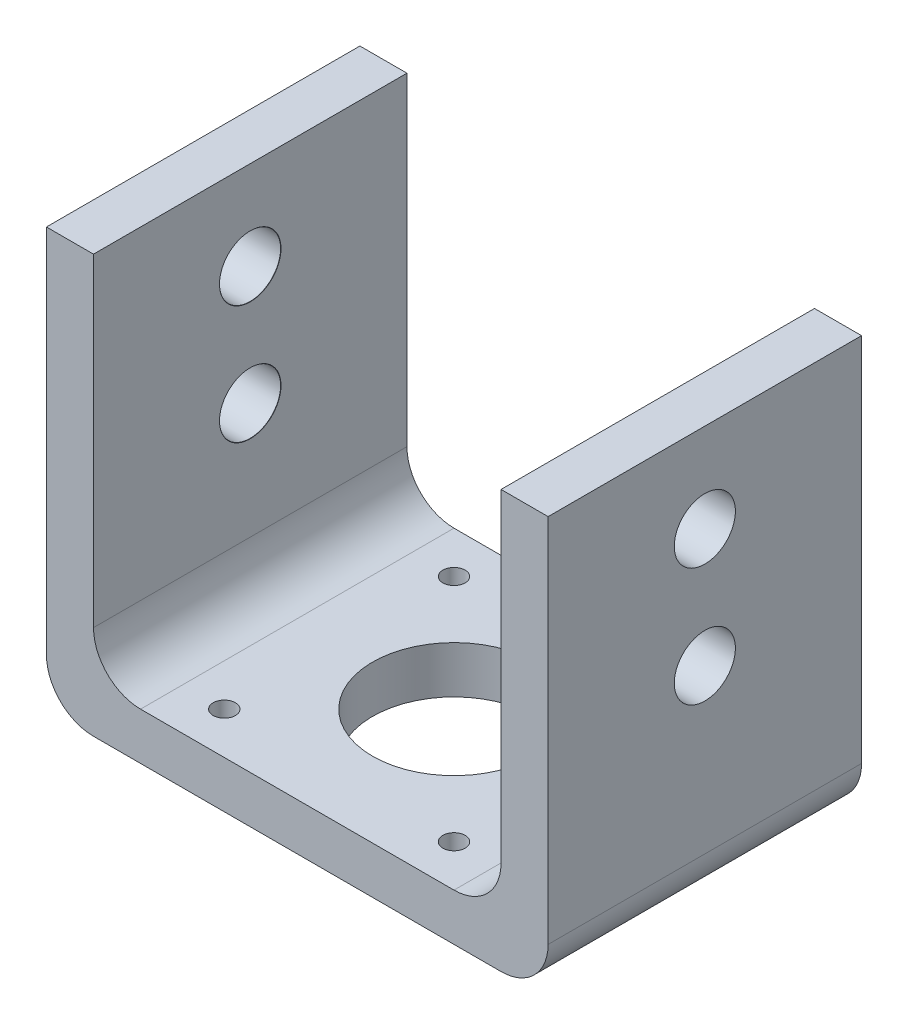
ISO-10303-21;
HEADER;
FILE_DESCRIPTION(('STEP AP214'),'2;1');
FILE_NAME('part.step','',(''),(''),'','','');
FILE_SCHEMA(('AUTOMOTIVE_DESIGN { 1 0 10303 214 1 1 1 1 }'));
ENDSEC;
DATA;
#1=APPLICATION_CONTEXT('core data for automotive mechanical design processes');
#2=APPLICATION_PROTOCOL_DEFINITION('international standard','automotive_design',2000,#1);
#3=PRODUCT_CONTEXT('',#1,'mechanical');
#4=PRODUCT('Part','Part','',(#3));
#5=PRODUCT_RELATED_PRODUCT_CATEGORY('part','',(#4));
#6=PRODUCT_DEFINITION_FORMATION('','',#4);
#7=PRODUCT_DEFINITION_CONTEXT('part definition',#1,'design');
#8=PRODUCT_DEFINITION('design','',#6,#7);
#9=PRODUCT_DEFINITION_SHAPE('','',#8);
#10=(LENGTH_UNIT() NAMED_UNIT(*) SI_UNIT(.MILLI.,.METRE.));
#11=(NAMED_UNIT(*) PLANE_ANGLE_UNIT() SI_UNIT($,.RADIAN.));
#12=(NAMED_UNIT(*) SI_UNIT($,.STERADIAN.) SOLID_ANGLE_UNIT());
#13=UNCERTAINTY_MEASURE_WITH_UNIT(LENGTH_MEASURE(1.E-05),#10,'distance_accuracy_value','');
#14=(GEOMETRIC_REPRESENTATION_CONTEXT(3) GLOBAL_UNCERTAINTY_ASSIGNED_CONTEXT((#13)) GLOBAL_UNIT_ASSIGNED_CONTEXT((#10,
#11,#12)) REPRESENTATION_CONTEXT('',''));
#15=CARTESIAN_POINT('',(0.,0.,0.));
#16=DIRECTION('',(0.,0.,1.));
#17=DIRECTION('',(1.,0.,0.));
#18=AXIS2_PLACEMENT_3D('',#15,#16,#17);
#19=CARTESIAN_POINT('',(0.,6.35,42.3));
#20=DIRECTION('',(0.,0.,-1.));
#21=DIRECTION('',(-1.,0.,0.));
#22=AXIS2_PLACEMENT_3D('',#19,#20,#21);
#23=PLANE('',#22);
#24=DIRECTION('',(0.,-1.,0.));
#25=VECTOR('',#24,1.);
#26=CARTESIAN_POINT('',(-12.7,6.35,42.3));
#27=LINE('',#26,#25);
#28=CARTESIAN_POINT('',(-12.7,56.35,42.3));
#29=VERTEX_POINT('',#28);
#30=CARTESIAN_POINT('',(-12.7,6.35,42.3));
#31=VERTEX_POINT('',#30);
#32=EDGE_CURVE('E142',#29,#31,#27,.T.);
#33=ORIENTED_EDGE('',*,*,#32,.T.);
#34=CARTESIAN_POINT('',(-6.35000000000001,6.35,42.3));
#35=DIRECTION('',(0.,0.,-1.));
#36=DIRECTION('',(-1.,0.,0.));
#37=AXIS2_PLACEMENT_3D('',#34,#35,#36);
#38=CIRCLE('',#37,6.35);
#39=CARTESIAN_POINT('',(-6.35000000000001,0.,42.3));
#40=VERTEX_POINT('',#39);
#41=EDGE_CURVE('E11',#31,#40,#38,.F.);
#42=ORIENTED_EDGE('',*,*,#41,.T.);
#43=DIRECTION('',(1.,0.,0.));
#44=VECTOR('',#43,1.);
#45=CARTESIAN_POINT('',(0.,0.,42.3));
#46=LINE('',#45,#44);
#47=CARTESIAN_POINT('',(48.65,0.,42.3));
#48=VERTEX_POINT('',#47);
#49=EDGE_CURVE('E264',#40,#48,#46,.T.);
#50=ORIENTED_EDGE('',*,*,#49,.T.);
#51=CARTESIAN_POINT('',(48.65,6.35,42.3));
#52=DIRECTION('',(0.,0.,-1.));
#53=DIRECTION('',(-1.,0.,0.));
#54=AXIS2_PLACEMENT_3D('',#51,#52,#53);
#55=CIRCLE('',#54,6.35);
#56=CARTESIAN_POINT('',(55.,6.35,42.3));
#57=VERTEX_POINT('',#56);
#58=EDGE_CURVE('E305',#48,#57,#55,.F.);
#59=ORIENTED_EDGE('',*,*,#58,.T.);
#60=DIRECTION('',(0.,-1.,0.));
#61=VECTOR('',#60,1.);
#62=CARTESIAN_POINT('',(55.,6.35,42.3));
#63=LINE('',#62,#61);
#64=CARTESIAN_POINT('',(55.,56.35,42.3));
#65=VERTEX_POINT('',#64);
#66=EDGE_CURVE('E220',#65,#57,#63,.T.);
#67=ORIENTED_EDGE('',*,*,#66,.F.);
#68=DIRECTION('',(1.,0.,0.));
#69=VECTOR('',#68,1.);
#70=CARTESIAN_POINT('',(48.65,56.35,42.3));
#71=LINE('',#70,#69);
#72=CARTESIAN_POINT('',(48.65,56.35,42.3));
#73=VERTEX_POINT('',#72);
#74=EDGE_CURVE('E201',#73,#65,#71,.T.);
#75=ORIENTED_EDGE('',*,*,#74,.F.);
#76=DIRECTION('',(0.,-1.,0.));
#77=VECTOR('',#76,1.);
#78=CARTESIAN_POINT('',(48.65,56.35,42.3));
#79=LINE('',#78,#77);
#80=CARTESIAN_POINT('',(48.65,12.7,42.3));
#81=VERTEX_POINT('',#80);
#82=EDGE_CURVE('E216',#73,#81,#79,.T.);
#83=ORIENTED_EDGE('',*,*,#82,.T.);
#84=CARTESIAN_POINT('',(42.3,12.7,42.3));
#85=DIRECTION('',(0.,0.,-1.));
#86=DIRECTION('',(-1.,0.,0.));
#87=AXIS2_PLACEMENT_3D('',#84,#85,#86);
#88=CIRCLE('',#87,6.35);
#89=CARTESIAN_POINT('',(42.3,6.35,42.3));
#90=VERTEX_POINT('',#89);
#91=EDGE_CURVE('E287',#81,#90,#88,.T.);
#92=ORIENTED_EDGE('',*,*,#91,.T.);
#93=DIRECTION('',(1.,0.,0.));
#94=VECTOR('',#93,1.);
#95=CARTESIAN_POINT('',(0.,6.35,42.3));
#96=LINE('',#95,#94);
#97=CARTESIAN_POINT('',(0.,6.35,42.3));
#98=VERTEX_POINT('',#97);
#99=EDGE_CURVE('E268',#98,#90,#96,.T.);
#100=ORIENTED_EDGE('',*,*,#99,.F.);
#101=CARTESIAN_POINT('',(0.,12.7,42.3));
#102=DIRECTION('',(0.,0.,-1.));
#103=DIRECTION('',(-1.,0.,0.));
#104=AXIS2_PLACEMENT_3D('',#101,#102,#103);
#105=CIRCLE('',#104,6.35);
#106=CARTESIAN_POINT('',(-6.35,12.7,42.3));
#107=VERTEX_POINT('',#106);
#108=EDGE_CURVE('E314',#98,#107,#105,.T.);
#109=ORIENTED_EDGE('',*,*,#108,.T.);
#110=DIRECTION('',(0.,-1.,0.));
#111=VECTOR('',#110,1.);
#112=CARTESIAN_POINT('',(-6.35,56.35,42.3));
#113=LINE('',#112,#111);
#114=CARTESIAN_POINT('',(-6.35,56.35,42.3));
#115=VERTEX_POINT('',#114);
#116=EDGE_CURVE('E143',#115,#107,#113,.T.);
#117=ORIENTED_EDGE('',*,*,#116,.F.);
#118=DIRECTION('',(-1.,0.,0.));
#119=VECTOR('',#118,1.);
#120=CARTESIAN_POINT('',(-6.35,56.35,42.3));
#121=LINE('',#120,#119);
#122=EDGE_CURVE('E152',#115,#29,#121,.T.);
#123=ORIENTED_EDGE('',*,*,#122,.T.);
#124=EDGE_LOOP('',(#33,#42,#50,#59,#67,#75,#83,#92,#100,#109,#117,#123));
#125=FACE_BOUND('',#124,.T.);
#126=ADVANCED_FACE('F43',(#125),#23,.F.);
#127=CARTESIAN_POINT('',(0.,6.35,0.));
#128=DIRECTION('',(0.,0.,1.));
#129=DIRECTION('',(1.,0.,0.));
#130=AXIS2_PLACEMENT_3D('',#127,#128,#129);
#131=PLANE('',#130);
#132=DIRECTION('',(-1.,0.,0.));
#133=VECTOR('',#132,1.);
#134=CARTESIAN_POINT('',(0.,0.,0.));
#135=LINE('',#134,#133);
#136=CARTESIAN_POINT('',(48.65,0.,0.));
#137=VERTEX_POINT('',#136);
#138=CARTESIAN_POINT('',(-6.35000000000001,0.,0.));
#139=VERTEX_POINT('',#138);
#140=EDGE_CURVE('E272',#137,#139,#135,.T.);
#141=ORIENTED_EDGE('',*,*,#140,.T.);
#142=CARTESIAN_POINT('',(-6.35000000000001,6.35,0.));
#143=DIRECTION('',(0.,0.,1.));
#144=DIRECTION('',(1.,0.,0.));
#145=AXIS2_PLACEMENT_3D('',#142,#143,#144);
#146=CIRCLE('',#145,6.35);
#147=CARTESIAN_POINT('',(-12.7,6.35,0.));
#148=VERTEX_POINT('',#147);
#149=EDGE_CURVE('E66',#139,#148,#146,.F.);
#150=ORIENTED_EDGE('',*,*,#149,.T.);
#151=DIRECTION('',(0.,1.,0.));
#152=VECTOR('',#151,1.);
#153=CARTESIAN_POINT('',(-12.7,6.35,0.));
#154=LINE('',#153,#152);
#155=CARTESIAN_POINT('',(-12.7,56.35,0.));
#156=VERTEX_POINT('',#155);
#157=EDGE_CURVE('E157',#148,#156,#154,.T.);
#158=ORIENTED_EDGE('',*,*,#157,.T.);
#159=DIRECTION('',(1.,0.,0.));
#160=VECTOR('',#159,1.);
#161=CARTESIAN_POINT('',(-6.35000000000001,56.35,0.));
#162=LINE('',#161,#160);
#163=CARTESIAN_POINT('',(-6.35000000000001,56.35,0.));
#164=VERTEX_POINT('',#163);
#165=EDGE_CURVE('E149',#156,#164,#162,.T.);
#166=ORIENTED_EDGE('',*,*,#165,.T.);
#167=DIRECTION('',(0.,-1.,0.));
#168=VECTOR('',#167,1.);
#169=CARTESIAN_POINT('',(-6.35000000000001,56.35,0.));
#170=LINE('',#169,#168);
#171=CARTESIAN_POINT('',(-6.35000000000001,12.7,0.));
#172=VERTEX_POINT('',#171);
#173=EDGE_CURVE('E131',#164,#172,#170,.T.);
#174=ORIENTED_EDGE('',*,*,#173,.T.);
#175=CARTESIAN_POINT('',(0.,12.7,0.));
#176=DIRECTION('',(0.,0.,1.));
#177=DIRECTION('',(1.,0.,0.));
#178=AXIS2_PLACEMENT_3D('',#175,#176,#177);
#179=CIRCLE('',#178,6.35);
#180=CARTESIAN_POINT('',(0.,6.35,0.));
#181=VERTEX_POINT('',#180);
#182=EDGE_CURVE('E317',#172,#181,#179,.T.);
#183=ORIENTED_EDGE('',*,*,#182,.T.);
#184=DIRECTION('',(-1.,0.,0.));
#185=VECTOR('',#184,1.);
#186=CARTESIAN_POINT('',(0.,6.35,0.));
#187=LINE('',#186,#185);
#188=CARTESIAN_POINT('',(42.3,6.35,0.));
#189=VERTEX_POINT('',#188);
#190=EDGE_CURVE('E271',#189,#181,#187,.T.);
#191=ORIENTED_EDGE('',*,*,#190,.F.);
#192=CARTESIAN_POINT('',(42.3,12.7,0.));
#193=DIRECTION('',(0.,0.,1.));
#194=DIRECTION('',(1.,0.,0.));
#195=AXIS2_PLACEMENT_3D('',#192,#193,#194);
#196=CIRCLE('',#195,6.35);
#197=CARTESIAN_POINT('',(48.65,12.7,0.));
#198=VERTEX_POINT('',#197);
#199=EDGE_CURVE('E291',#189,#198,#196,.T.);
#200=ORIENTED_EDGE('',*,*,#199,.T.);
#201=DIRECTION('',(0.,-1.,0.));
#202=VECTOR('',#201,1.);
#203=CARTESIAN_POINT('',(48.65,56.35,0.));
#204=LINE('',#203,#202);
#205=CARTESIAN_POINT('',(48.65,56.35,0.));
#206=VERTEX_POINT('',#205);
#207=EDGE_CURVE('E212',#206,#198,#204,.T.);
#208=ORIENTED_EDGE('',*,*,#207,.F.);
#209=DIRECTION('',(-1.,0.,0.));
#210=VECTOR('',#209,1.);
#211=CARTESIAN_POINT('',(48.65,56.35,0.));
#212=LINE('',#211,#210);
#213=CARTESIAN_POINT('',(55.,56.35,0.));
#214=VERTEX_POINT('',#213);
#215=EDGE_CURVE('E209',#214,#206,#212,.T.);
#216=ORIENTED_EDGE('',*,*,#215,.F.);
#217=DIRECTION('',(0.,1.,0.));
#218=VECTOR('',#217,1.);
#219=CARTESIAN_POINT('',(55.,6.35,0.));
#220=LINE('',#219,#218);
#221=CARTESIAN_POINT('',(55.,6.35,0.));
#222=VERTEX_POINT('',#221);
#223=EDGE_CURVE('E224',#222,#214,#220,.T.);
#224=ORIENTED_EDGE('',*,*,#223,.F.);
#225=CARTESIAN_POINT('',(48.65,6.35,0.));
#226=DIRECTION('',(0.,0.,1.));
#227=DIRECTION('',(1.,0.,0.));
#228=AXIS2_PLACEMENT_3D('',#225,#226,#227);
#229=CIRCLE('',#228,6.35);
#230=EDGE_CURVE('E298',#222,#137,#229,.F.);
#231=ORIENTED_EDGE('',*,*,#230,.T.);
#232=EDGE_LOOP('',(#141,#150,#158,#166,#174,#183,#191,#200,#208,#216,#224,#231));
#233=FACE_BOUND('',#232,.T.);
#234=ADVANCED_FACE('F156',(#233),#131,.F.);
#235=CARTESIAN_POINT('',(0.,6.35,0.));
#236=DIRECTION('',(0.,1.,0.));
#237=DIRECTION('',(0.,0.,1.));
#238=AXIS2_PLACEMENT_3D('',#235,#236,#237);
#239=PLANE('',#238);
#240=ORIENTED_EDGE('',*,*,#190,.T.);
#241=DIRECTION('',(0.,0.,1.));
#242=VECTOR('',#241,1.);
#243=CARTESIAN_POINT('',(0.,6.35,42.3));
#244=LINE('',#243,#242);
#245=EDGE_CURVE('E308',#181,#98,#244,.T.);
#246=ORIENTED_EDGE('',*,*,#245,.T.);
#247=ORIENTED_EDGE('',*,*,#99,.T.);
#248=DIRECTION('',(0.,0.,1.));
#249=VECTOR('',#248,1.);
#250=CARTESIAN_POINT('',(42.3,6.35,0.));
#251=LINE('',#250,#249);
#252=EDGE_CURVE('E284',#90,#189,#251,.F.);
#253=ORIENTED_EDGE('',*,*,#252,.T.);
#254=EDGE_LOOP('',(#240,#246,#247,#253));
#255=FACE_BOUND('',#254,.T.);
#256=CARTESIAN_POINT('',(36.65,6.35,36.65));
#257=DIRECTION('',(0.,1.,0.));
#258=DIRECTION('',(0.,0.,1.));
#259=AXIS2_PLACEMENT_3D('',#256,#257,#258);
#260=CIRCLE('',#259,1.5);
#261=CARTESIAN_POINT('',(36.65,6.35,38.15));
#262=VERTEX_POINT('',#261);
#263=EDGE_CURVE('E253',#262,#262,#260,.T.);
#264=ORIENTED_EDGE('',*,*,#263,.F.);
#265=EDGE_LOOP('',(#264));
#266=FACE_BOUND('',#265,.T.);
#267=CARTESIAN_POINT('',(36.65,6.35,5.65));
#268=DIRECTION('',(0.,1.,0.));
#269=DIRECTION('',(0.,0.,1.));
#270=AXIS2_PLACEMENT_3D('',#267,#268,#269);
#271=CIRCLE('',#270,1.5);
#272=CARTESIAN_POINT('',(36.65,6.35,7.15));
#273=VERTEX_POINT('',#272);
#274=EDGE_CURVE('E245',#273,#273,#271,.T.);
#275=ORIENTED_EDGE('',*,*,#274,.F.);
#276=EDGE_LOOP('',(#275));
#277=FACE_BOUND('',#276,.T.);
#278=CARTESIAN_POINT('',(5.65,6.35,36.65));
#279=DIRECTION('',(0.,1.,0.));
#280=DIRECTION('',(0.,0.,1.));
#281=AXIS2_PLACEMENT_3D('',#278,#279,#280);
#282=CIRCLE('',#281,1.5);
#283=CARTESIAN_POINT('',(5.65,6.35,38.15));
#284=VERTEX_POINT('',#283);
#285=EDGE_CURVE('E237',#284,#284,#282,.T.);
#286=ORIENTED_EDGE('',*,*,#285,.F.);
#287=EDGE_LOOP('',(#286));
#288=FACE_BOUND('',#287,.T.);
#289=CARTESIAN_POINT('',(5.65,6.35,5.65));
#290=DIRECTION('',(0.,1.,0.));
#291=DIRECTION('',(0.,0.,1.));
#292=AXIS2_PLACEMENT_3D('',#289,#290,#291);
#293=CIRCLE('',#292,1.5);
#294=CARTESIAN_POINT('',(5.65,6.35,7.15));
#295=VERTEX_POINT('',#294);
#296=EDGE_CURVE('E228',#295,#295,#293,.T.);
#297=ORIENTED_EDGE('',*,*,#296,.F.);
#298=EDGE_LOOP('',(#297));
#299=FACE_BOUND('',#298,.T.);
#300=CARTESIAN_POINT('',(21.15,6.35,21.15));
#301=DIRECTION('',(0.,1.,0.));
#302=DIRECTION('',(0.,0.,1.));
#303=AXIS2_PLACEMENT_3D('',#300,#301,#302);
#304=CIRCLE('',#303,11.);
#305=CARTESIAN_POINT('',(21.15,6.35,32.15));
#306=VERTEX_POINT('',#305);
#307=EDGE_CURVE('E232',#306,#306,#304,.T.);
#308=ORIENTED_EDGE('',*,*,#307,.F.);
#309=EDGE_LOOP('',(#308));
#310=FACE_BOUND('',#309,.T.);
#311=ADVANCED_FACE('F359',(#255,#266,#277,#288,#299,#310),#239,.T.);
#312=CARTESIAN_POINT('',(0.,0.,0.));
#313=DIRECTION('',(0.,1.,0.));
#314=DIRECTION('',(0.,0.,1.));
#315=AXIS2_PLACEMENT_3D('',#312,#313,#314);
#316=PLANE('',#315);
#317=CARTESIAN_POINT('',(36.65,0.,36.65));
#318=DIRECTION('',(0.,1.,0.));
#319=DIRECTION('',(0.,0.,1.));
#320=AXIS2_PLACEMENT_3D('',#317,#318,#319);
#321=CIRCLE('',#320,1.5);
#322=CARTESIAN_POINT('',(36.65,0.,38.15));
#323=VERTEX_POINT('',#322);
#324=EDGE_CURVE('E227',#323,#323,#321,.T.);
#325=ORIENTED_EDGE('',*,*,#324,.T.);
#326=EDGE_LOOP('',(#325));
#327=FACE_BOUND('',#326,.T.);
#328=CARTESIAN_POINT('',(36.65,0.,5.65));
#329=DIRECTION('',(0.,1.,0.));
#330=DIRECTION('',(0.,0.,1.));
#331=AXIS2_PLACEMENT_3D('',#328,#329,#330);
#332=CIRCLE('',#331,1.5);
#333=CARTESIAN_POINT('',(36.65,0.,7.15));
#334=VERTEX_POINT('',#333);
#335=EDGE_CURVE('E249',#334,#334,#332,.T.);
#336=ORIENTED_EDGE('',*,*,#335,.T.);
#337=EDGE_LOOP('',(#336));
#338=FACE_BOUND('',#337,.T.);
#339=CARTESIAN_POINT('',(5.65,0.,36.65));
#340=DIRECTION('',(0.,1.,0.));
#341=DIRECTION('',(0.,0.,1.));
#342=AXIS2_PLACEMENT_3D('',#339,#340,#341);
#343=CIRCLE('',#342,1.5);
#344=CARTESIAN_POINT('',(5.65,0.,38.15));
#345=VERTEX_POINT('',#344);
#346=EDGE_CURVE('E241',#345,#345,#343,.T.);
#347=ORIENTED_EDGE('',*,*,#346,.T.);
#348=EDGE_LOOP('',(#347));
#349=FACE_BOUND('',#348,.T.);
#350=CARTESIAN_POINT('',(5.65,0.,5.65));
#351=DIRECTION('',(0.,1.,0.));
#352=DIRECTION('',(0.,0.,1.));
#353=AXIS2_PLACEMENT_3D('',#350,#351,#352);
#354=CIRCLE('',#353,1.5);
#355=CARTESIAN_POINT('',(5.65,0.,7.15));
#356=VERTEX_POINT('',#355);
#357=EDGE_CURVE('E233',#356,#356,#354,.T.);
#358=ORIENTED_EDGE('',*,*,#357,.T.);
#359=EDGE_LOOP('',(#358));
#360=FACE_BOUND('',#359,.T.);
#361=CARTESIAN_POINT('',(21.15,0.,21.15));
#362=DIRECTION('',(0.,1.,0.));
#363=DIRECTION('',(0.,0.,1.));
#364=AXIS2_PLACEMENT_3D('',#361,#362,#363);
#365=CIRCLE('',#364,11.);
#366=CARTESIAN_POINT('',(21.15,0.,32.15));
#367=VERTEX_POINT('',#366);
#368=EDGE_CURVE('E260',#367,#367,#365,.T.);
#369=ORIENTED_EDGE('',*,*,#368,.T.);
#370=EDGE_LOOP('',(#369));
#371=FACE_BOUND('',#370,.T.);
#372=ORIENTED_EDGE('',*,*,#49,.F.);
#373=DIRECTION('',(0.,0.,-1.));
#374=VECTOR('',#373,1.);
#375=CARTESIAN_POINT('',(-6.35000000000001,0.,0.));
#376=LINE('',#375,#374);
#377=EDGE_CURVE('E320',#40,#139,#376,.T.);
#378=ORIENTED_EDGE('',*,*,#377,.T.);
#379=ORIENTED_EDGE('',*,*,#140,.F.);
#380=DIRECTION('',(0.,0.,-1.));
#381=VECTOR('',#380,1.);
#382=CARTESIAN_POINT('',(48.65,0.,42.3));
#383=LINE('',#382,#381);
#384=EDGE_CURVE('E301',#137,#48,#383,.F.);
#385=ORIENTED_EDGE('',*,*,#384,.T.);
#386=EDGE_LOOP('',(#372,#378,#379,#385));
#387=FACE_BOUND('',#386,.T.);
#388=ADVANCED_FACE('F330',(#327,#338,#349,#360,#371,#387),#316,.F.);
#389=CARTESIAN_POINT('',(21.15,0.,21.15));
#390=DIRECTION('',(0.,1.,0.));
#391=DIRECTION('',(0.,0.,1.));
#392=AXIS2_PLACEMENT_3D('',#389,#390,#391);
#393=CYLINDRICAL_SURFACE('',#392,11.);
#394=ORIENTED_EDGE('',*,*,#368,.F.);
#395=EDGE_LOOP('',(#394));
#396=FACE_BOUND('',#395,.T.);
#397=ORIENTED_EDGE('',*,*,#307,.T.);
#398=EDGE_LOOP('',(#397));
#399=FACE_BOUND('',#398,.T.);
#400=ADVANCED_FACE('F414',(#396,#399),#393,.F.);
#401=CARTESIAN_POINT('',(5.65,0.,5.65));
#402=DIRECTION('',(0.,1.,0.));
#403=DIRECTION('',(0.,0.,1.));
#404=AXIS2_PLACEMENT_3D('',#401,#402,#403);
#405=CYLINDRICAL_SURFACE('',#404,1.5);
#406=ORIENTED_EDGE('',*,*,#357,.F.);
#407=EDGE_LOOP('',(#406));
#408=FACE_BOUND('',#407,.T.);
#409=ORIENTED_EDGE('',*,*,#296,.T.);
#410=EDGE_LOOP('',(#409));
#411=FACE_BOUND('',#410,.T.);
#412=ADVANCED_FACE('F410',(#408,#411),#405,.F.);
#413=CARTESIAN_POINT('',(5.65,0.,36.65));
#414=DIRECTION('',(0.,1.,0.));
#415=DIRECTION('',(0.,0.,1.));
#416=AXIS2_PLACEMENT_3D('',#413,#414,#415);
#417=CYLINDRICAL_SURFACE('',#416,1.5);
#418=ORIENTED_EDGE('',*,*,#346,.F.);
#419=EDGE_LOOP('',(#418));
#420=FACE_BOUND('',#419,.T.);
#421=ORIENTED_EDGE('',*,*,#285,.T.);
#422=EDGE_LOOP('',(#421));
#423=FACE_BOUND('',#422,.T.);
#424=ADVANCED_FACE('F413',(#420,#423),#417,.F.);
#425=CARTESIAN_POINT('',(36.65,0.,5.65));
#426=DIRECTION('',(0.,1.,0.));
#427=DIRECTION('',(0.,0.,1.));
#428=AXIS2_PLACEMENT_3D('',#425,#426,#427);
#429=CYLINDRICAL_SURFACE('',#428,1.5);
#430=ORIENTED_EDGE('',*,*,#335,.F.);
#431=EDGE_LOOP('',(#430));
#432=FACE_BOUND('',#431,.T.);
#433=ORIENTED_EDGE('',*,*,#274,.T.);
#434=EDGE_LOOP('',(#433));
#435=FACE_BOUND('',#434,.T.);
#436=ADVANCED_FACE('F418',(#432,#435),#429,.F.);
#437=CARTESIAN_POINT('',(36.65,0.,36.65));
#438=DIRECTION('',(0.,1.,0.));
#439=DIRECTION('',(0.,0.,1.));
#440=AXIS2_PLACEMENT_3D('',#437,#438,#439);
#441=CYLINDRICAL_SURFACE('',#440,1.5);
#442=ORIENTED_EDGE('',*,*,#324,.F.);
#443=EDGE_LOOP('',(#442));
#444=FACE_BOUND('',#443,.T.);
#445=ORIENTED_EDGE('',*,*,#263,.T.);
#446=EDGE_LOOP('',(#445));
#447=FACE_BOUND('',#446,.T.);
#448=ADVANCED_FACE('F408',(#444,#447),#441,.F.);
#449=CARTESIAN_POINT('',(55.,0.,0.));
#450=DIRECTION('',(1.,0.,0.));
#451=DIRECTION('',(0.,0.,-1.));
#452=AXIS2_PLACEMENT_3D('',#449,#450,#451);
#453=PLANE('',#452);
#454=CARTESIAN_POINT('',(55.,44.35,21.15));
#455=DIRECTION('',(-1.,0.,0.));
#456=DIRECTION('',(0.,0.,1.));
#457=AXIS2_PLACEMENT_3D('',#454,#455,#456);
#458=CIRCLE('',#457,4.125);
#459=CARTESIAN_POINT('',(55.,44.35,25.275));
#460=VERTEX_POINT('',#459);
#461=EDGE_CURVE('E181',#460,#460,#458,.T.);
#462=ORIENTED_EDGE('',*,*,#461,.T.);
#463=EDGE_LOOP('',(#462));
#464=FACE_BOUND('',#463,.T.);
#465=CARTESIAN_POINT('',(55.,28.35,21.15));
#466=DIRECTION('',(-1.,0.,0.));
#467=DIRECTION('',(0.,0.,1.));
#468=AXIS2_PLACEMENT_3D('',#465,#466,#467);
#469=CIRCLE('',#468,4.125);
#470=CARTESIAN_POINT('',(55.,28.35,25.275));
#471=VERTEX_POINT('',#470);
#472=EDGE_CURVE('E193',#471,#471,#469,.T.);
#473=ORIENTED_EDGE('',*,*,#472,.T.);
#474=EDGE_LOOP('',(#473));
#475=FACE_BOUND('',#474,.T.);
#476=ORIENTED_EDGE('',*,*,#66,.T.);
#477=DIRECTION('',(0.,0.,-1.));
#478=VECTOR('',#477,1.);
#479=CARTESIAN_POINT('',(55.,6.35,0.));
#480=LINE('',#479,#478);
#481=EDGE_CURVE('E294',#57,#222,#480,.T.);
#482=ORIENTED_EDGE('',*,*,#481,.T.);
#483=ORIENTED_EDGE('',*,*,#223,.T.);
#484=DIRECTION('',(0.,0.,-1.));
#485=VECTOR('',#484,1.);
#486=CARTESIAN_POINT('',(55.,56.35,0.));
#487=LINE('',#486,#485);
#488=EDGE_CURVE('E205',#65,#214,#487,.T.);
#489=ORIENTED_EDGE('',*,*,#488,.F.);
#490=EDGE_LOOP('',(#476,#482,#483,#489));
#491=FACE_BOUND('',#490,.T.);
#492=ADVANCED_FACE('F341',(#464,#475,#491),#453,.T.);
#493=CARTESIAN_POINT('',(48.65,56.35,0.));
#494=DIRECTION('',(1.,0.,0.));
#495=DIRECTION('',(0.,0.,-1.));
#496=AXIS2_PLACEMENT_3D('',#493,#494,#495);
#497=PLANE('',#496);
#498=CARTESIAN_POINT('',(48.65,44.35,21.15));
#499=DIRECTION('',(-1.,0.,0.));
#500=DIRECTION('',(0.,0.,1.));
#501=AXIS2_PLACEMENT_3D('',#498,#499,#500);
#502=CIRCLE('',#501,4.15);
#503=CARTESIAN_POINT('',(48.65,44.35,25.3));
#504=VERTEX_POINT('',#503);
#505=EDGE_CURVE('E173',#504,#504,#502,.T.);
#506=ORIENTED_EDGE('',*,*,#505,.F.);
#507=EDGE_LOOP('',(#506));
#508=FACE_BOUND('',#507,.T.);
#509=CARTESIAN_POINT('',(48.65,28.35,21.15));
#510=DIRECTION('',(-1.,0.,0.));
#511=DIRECTION('',(0.,0.,1.));
#512=AXIS2_PLACEMENT_3D('',#509,#510,#511);
#513=CIRCLE('',#512,4.15);
#514=CARTESIAN_POINT('',(48.65,28.35,25.3));
#515=VERTEX_POINT('',#514);
#516=EDGE_CURVE('E185',#515,#515,#513,.T.);
#517=ORIENTED_EDGE('',*,*,#516,.F.);
#518=EDGE_LOOP('',(#517));
#519=FACE_BOUND('',#518,.T.);
#520=ORIENTED_EDGE('',*,*,#207,.T.);
#521=DIRECTION('',(0.,0.,1.));
#522=VECTOR('',#521,1.);
#523=CARTESIAN_POINT('',(48.65,12.7,0.));
#524=LINE('',#523,#522);
#525=EDGE_CURVE('E276',#198,#81,#524,.T.);
#526=ORIENTED_EDGE('',*,*,#525,.T.);
#527=ORIENTED_EDGE('',*,*,#82,.F.);
#528=DIRECTION('',(0.,0.,1.));
#529=VECTOR('',#528,1.);
#530=CARTESIAN_POINT('',(48.65,56.35,0.));
#531=LINE('',#530,#529);
#532=EDGE_CURVE('E197',#206,#73,#531,.T.);
#533=ORIENTED_EDGE('',*,*,#532,.F.);
#534=EDGE_LOOP('',(#520,#526,#527,#533));
#535=FACE_BOUND('',#534,.T.);
#536=ADVANCED_FACE('F350',(#508,#519,#535),#497,.F.);
#537=CARTESIAN_POINT('',(0.,56.35,0.));
#538=DIRECTION('',(0.,1.,0.));
#539=DIRECTION('',(0.,0.,1.));
#540=AXIS2_PLACEMENT_3D('',#537,#538,#539);
#541=PLANE('',#540);
#542=ORIENTED_EDGE('',*,*,#532,.T.);
#543=ORIENTED_EDGE('',*,*,#74,.T.);
#544=ORIENTED_EDGE('',*,*,#488,.T.);
#545=ORIENTED_EDGE('',*,*,#215,.T.);
#546=EDGE_LOOP('',(#542,#543,#544,#545));
#547=FACE_BOUND('',#546,.T.);
#548=ADVANCED_FACE('F345',(#547),#541,.T.);
#549=CARTESIAN_POINT('',(42.3,12.7,0.));
#550=DIRECTION('',(0.,0.,1.));
#551=DIRECTION('',(1.,0.,0.));
#552=AXIS2_PLACEMENT_3D('',#549,#550,#551);
#553=CYLINDRICAL_SURFACE('',#552,6.35);
#554=ORIENTED_EDGE('',*,*,#199,.F.);
#555=ORIENTED_EDGE('',*,*,#252,.F.);
#556=ORIENTED_EDGE('',*,*,#91,.F.);
#557=ORIENTED_EDGE('',*,*,#525,.F.);
#558=EDGE_LOOP('',(#554,#555,#556,#557));
#559=FACE_BOUND('',#558,.T.);
#560=ADVANCED_FACE('F356',(#559),#553,.F.);
#561=CARTESIAN_POINT('',(48.65,6.35,0.));
#562=DIRECTION('',(0.,0.,1.));
#563=DIRECTION('',(1.,0.,0.));
#564=AXIS2_PLACEMENT_3D('',#561,#562,#563);
#565=CYLINDRICAL_SURFACE('',#564,6.35);
#566=ORIENTED_EDGE('',*,*,#58,.F.);
#567=ORIENTED_EDGE('',*,*,#384,.F.);
#568=ORIENTED_EDGE('',*,*,#230,.F.);
#569=ORIENTED_EDGE('',*,*,#481,.F.);
#570=EDGE_LOOP('',(#566,#567,#568,#569));
#571=FACE_BOUND('',#570,.T.);
#572=ADVANCED_FACE('F339',(#571),#565,.T.);
#573=CARTESIAN_POINT('',(48.65,28.35,21.15));
#574=DIRECTION('',(-1.,0.,0.));
#575=DIRECTION('',(0.,0.,1.));
#576=AXIS2_PLACEMENT_3D('',#573,#574,#575);
#577=CYLINDRICAL_SURFACE('',#576,4.125);
#578=ORIENTED_EDGE('',*,*,#472,.F.);
#579=EDGE_LOOP('',(#578));
#580=FACE_BOUND('',#579,.T.);
#581=CARTESIAN_POINT('',(48.675,28.35,21.15));
#582=DIRECTION('',(-1.,0.,0.));
#583=DIRECTION('',(0.,0.,1.));
#584=AXIS2_PLACEMENT_3D('',#581,#582,#583);
#585=CIRCLE('',#584,4.125);
#586=CARTESIAN_POINT('',(48.675,28.35,25.275));
#587=VERTEX_POINT('',#586);
#588=EDGE_CURVE('E189',#587,#587,#585,.T.);
#589=ORIENTED_EDGE('',*,*,#588,.T.);
#590=EDGE_LOOP('',(#589));
#591=FACE_BOUND('',#590,.T.);
#592=ADVANCED_FACE('F384',(#580,#591),#577,.F.);
#593=CARTESIAN_POINT('',(48.65,28.35,21.15));
#594=DIRECTION('',(-1.,0.,0.));
#595=DIRECTION('',(0.,0.,1.));
#596=AXIS2_PLACEMENT_3D('',#593,#594,#595);
#597=CONICAL_SURFACE('',#596,4.15,0.785398163397448);
#598=ORIENTED_EDGE('',*,*,#588,.F.);
#599=EDGE_LOOP('',(#598));
#600=FACE_BOUND('',#599,.T.);
#601=ORIENTED_EDGE('',*,*,#516,.T.);
#602=EDGE_LOOP('',(#601));
#603=FACE_BOUND('',#602,.T.);
#604=ADVANCED_FACE('F388',(#600,#603),#597,.F.);
#605=CARTESIAN_POINT('',(48.65,44.35,21.15));
#606=DIRECTION('',(-1.,0.,0.));
#607=DIRECTION('',(0.,0.,1.));
#608=AXIS2_PLACEMENT_3D('',#605,#606,#607);
#609=CYLINDRICAL_SURFACE('',#608,4.125);
#610=ORIENTED_EDGE('',*,*,#461,.F.);
#611=EDGE_LOOP('',(#610));
#612=FACE_BOUND('',#611,.T.);
#613=CARTESIAN_POINT('',(48.675,44.35,21.15));
#614=DIRECTION('',(-1.,0.,0.));
#615=DIRECTION('',(0.,0.,1.));
#616=AXIS2_PLACEMENT_3D('',#613,#614,#615);
#617=CIRCLE('',#616,4.125);
#618=CARTESIAN_POINT('',(48.675,44.35,25.275));
#619=VERTEX_POINT('',#618);
#620=EDGE_CURVE('E177',#619,#619,#617,.T.);
#621=ORIENTED_EDGE('',*,*,#620,.T.);
#622=EDGE_LOOP('',(#621));
#623=FACE_BOUND('',#622,.T.);
#624=ADVANCED_FACE('F394',(#612,#623),#609,.F.);
#625=CARTESIAN_POINT('',(48.65,44.35,21.15));
#626=DIRECTION('',(-1.,0.,0.));
#627=DIRECTION('',(0.,0.,1.));
#628=AXIS2_PLACEMENT_3D('',#625,#626,#627);
#629=CONICAL_SURFACE('',#628,4.15,0.785398163397448);
#630=ORIENTED_EDGE('',*,*,#620,.F.);
#631=EDGE_LOOP('',(#630));
#632=FACE_BOUND('',#631,.T.);
#633=ORIENTED_EDGE('',*,*,#505,.T.);
#634=EDGE_LOOP('',(#633));
#635=FACE_BOUND('',#634,.T.);
#636=ADVANCED_FACE('F527',(#632,#635),#629,.F.);
#637=CARTESIAN_POINT('',(-12.7,0.,0.));
#638=DIRECTION('',(-1.,0.,0.));
#639=DIRECTION('',(0.,0.,-1.));
#640=AXIS2_PLACEMENT_3D('',#637,#638,#639);
#641=PLANE('',#640);
#642=CARTESIAN_POINT('',(-12.7,44.35,21.15));
#643=DIRECTION('',(1.,0.,0.));
#644=DIRECTION('',(0.,0.,-1.));
#645=AXIS2_PLACEMENT_3D('',#642,#643,#644);
#646=CIRCLE('',#645,4.125);
#647=CARTESIAN_POINT('',(-12.7,44.35,17.025));
#648=VERTEX_POINT('',#647);
#649=EDGE_CURVE('E674',#648,#648,#646,.T.);
#650=ORIENTED_EDGE('',*,*,#649,.T.);
#651=EDGE_LOOP('',(#650));
#652=FACE_BOUND('',#651,.T.);
#653=CARTESIAN_POINT('',(-12.7,28.35,21.15));
#654=DIRECTION('',(1.,0.,0.));
#655=DIRECTION('',(0.,0.,-1.));
#656=AXIS2_PLACEMENT_3D('',#653,#654,#655);
#657=CIRCLE('',#656,4.125);
#658=CARTESIAN_POINT('',(-12.7,28.35,17.025));
#659=VERTEX_POINT('',#658);
#660=EDGE_CURVE('E154',#659,#659,#657,.T.);
#661=ORIENTED_EDGE('',*,*,#660,.T.);
#662=EDGE_LOOP('',(#661));
#663=FACE_BOUND('',#662,.T.);
#664=ORIENTED_EDGE('',*,*,#157,.F.);
#665=DIRECTION('',(0.,0.,-1.));
#666=VECTOR('',#665,1.);
#667=CARTESIAN_POINT('',(-12.7,6.35,42.3));
#668=LINE('',#667,#666);
#669=EDGE_CURVE('E52',#148,#31,#668,.F.);
#670=ORIENTED_EDGE('',*,*,#669,.T.);
#671=ORIENTED_EDGE('',*,*,#32,.F.);
#672=DIRECTION('',(0.,0.,-1.));
#673=VECTOR('',#672,1.);
#674=CARTESIAN_POINT('',(-12.7,56.35,0.));
#675=LINE('',#674,#673);
#676=EDGE_CURVE('E159',#29,#156,#675,.T.);
#677=ORIENTED_EDGE('',*,*,#676,.T.);
#678=EDGE_LOOP('',(#664,#670,#671,#677));
#679=FACE_BOUND('',#678,.T.);
#680=ADVANCED_FACE('F537',(#652,#663,#679),#641,.T.);
#681=CARTESIAN_POINT('',(-6.35000000000001,56.35,0.));
#682=DIRECTION('',(1.,0.,0.));
#683=DIRECTION('',(0.,0.,-1.));
#684=AXIS2_PLACEMENT_3D('',#681,#682,#683);
#685=PLANE('',#684);
#686=CARTESIAN_POINT('',(-6.35000000000001,44.35,21.15));
#687=DIRECTION('',(1.,0.,0.));
#688=DIRECTION('',(0.,0.,-1.));
#689=AXIS2_PLACEMENT_3D('',#686,#687,#688);
#690=CIRCLE('',#689,4.15);
#691=CARTESIAN_POINT('',(-6.35000000000001,44.35,17.));
#692=VERTEX_POINT('',#691);
#693=EDGE_CURVE('E670',#692,#692,#690,.T.);
#694=ORIENTED_EDGE('',*,*,#693,.F.);
#695=EDGE_LOOP('',(#694));
#696=FACE_BOUND('',#695,.T.);
#697=CARTESIAN_POINT('',(-6.35000000000001,28.35,21.15));
#698=DIRECTION('',(1.,0.,0.));
#699=DIRECTION('',(0.,0.,-1.));
#700=AXIS2_PLACEMENT_3D('',#697,#698,#699);
#701=CIRCLE('',#700,4.15);
#702=CARTESIAN_POINT('',(-6.35000000000001,28.35,17.));
#703=VERTEX_POINT('',#702);
#704=EDGE_CURVE('E680',#703,#703,#701,.T.);
#705=ORIENTED_EDGE('',*,*,#704,.F.);
#706=EDGE_LOOP('',(#705));
#707=FACE_BOUND('',#706,.T.);
#708=ORIENTED_EDGE('',*,*,#116,.T.);
#709=DIRECTION('',(0.,0.,1.));
#710=VECTOR('',#709,1.);
#711=CARTESIAN_POINT('',(-6.35000000000001,12.7,0.));
#712=LINE('',#711,#710);
#713=EDGE_CURVE('E138',#107,#172,#712,.F.);
#714=ORIENTED_EDGE('',*,*,#713,.T.);
#715=ORIENTED_EDGE('',*,*,#173,.F.);
#716=DIRECTION('',(0.,0.,1.));
#717=VECTOR('',#716,1.);
#718=CARTESIAN_POINT('',(-6.35000000000001,56.35,0.));
#719=LINE('',#718,#717);
#720=EDGE_CURVE('E135',#164,#115,#719,.T.);
#721=ORIENTED_EDGE('',*,*,#720,.T.);
#722=EDGE_LOOP('',(#708,#714,#715,#721));
#723=FACE_BOUND('',#722,.T.);
#724=ADVANCED_FACE('F134',(#696,#707,#723),#685,.T.);
#725=CARTESIAN_POINT('',(42.3,56.35,0.));
#726=DIRECTION('',(0.,1.,0.));
#727=DIRECTION('',(0.,0.,1.));
#728=AXIS2_PLACEMENT_3D('',#725,#726,#727);
#729=PLANE('',#728);
#730=ORIENTED_EDGE('',*,*,#720,.F.);
#731=ORIENTED_EDGE('',*,*,#165,.F.);
#732=ORIENTED_EDGE('',*,*,#676,.F.);
#733=ORIENTED_EDGE('',*,*,#122,.F.);
#734=EDGE_LOOP('',(#730,#731,#732,#733));
#735=FACE_BOUND('',#734,.T.);
#736=ADVANCED_FACE('F147',(#735),#729,.T.);
#737=CARTESIAN_POINT('',(0.,12.7,0.));
#738=DIRECTION('',(0.,0.,-1.));
#739=DIRECTION('',(-1.,0.,0.));
#740=AXIS2_PLACEMENT_3D('',#737,#738,#739);
#741=CYLINDRICAL_SURFACE('',#740,6.35);
#742=ORIENTED_EDGE('',*,*,#182,.F.);
#743=ORIENTED_EDGE('',*,*,#713,.F.);
#744=ORIENTED_EDGE('',*,*,#108,.F.);
#745=ORIENTED_EDGE('',*,*,#245,.F.);
#746=EDGE_LOOP('',(#742,#743,#744,#745));
#747=FACE_BOUND('',#746,.T.);
#748=ADVANCED_FACE('F363',(#747),#741,.F.);
#749=CARTESIAN_POINT('',(-6.35000000000001,6.35,0.));
#750=DIRECTION('',(0.,0.,1.));
#751=DIRECTION('',(1.,0.,0.));
#752=AXIS2_PLACEMENT_3D('',#749,#750,#751);
#753=CYLINDRICAL_SURFACE('',#752,6.35);
#754=ORIENTED_EDGE('',*,*,#41,.F.);
#755=ORIENTED_EDGE('',*,*,#669,.F.);
#756=ORIENTED_EDGE('',*,*,#149,.F.);
#757=ORIENTED_EDGE('',*,*,#377,.F.);
#758=EDGE_LOOP('',(#754,#755,#756,#757));
#759=FACE_BOUND('',#758,.T.);
#760=ADVANCED_FACE('F45',(#759),#753,.T.);
#761=CARTESIAN_POINT('',(-6.35000000000001,28.35,21.15));
#762=DIRECTION('',(1.,0.,0.));
#763=DIRECTION('',(0.,0.,-1.));
#764=AXIS2_PLACEMENT_3D('',#761,#762,#763);
#765=CYLINDRICAL_SURFACE('',#764,4.125);
#766=ORIENTED_EDGE('',*,*,#660,.F.);
#767=EDGE_LOOP('',(#766));
#768=FACE_BOUND('',#767,.T.);
#769=CARTESIAN_POINT('',(-6.37500000000001,28.35,21.15));
#770=DIRECTION('',(1.,0.,0.));
#771=DIRECTION('',(0.,0.,-1.));
#772=AXIS2_PLACEMENT_3D('',#769,#770,#771);
#773=CIRCLE('',#772,4.125);
#774=CARTESIAN_POINT('',(-6.37500000000001,28.35,17.025));
#775=VERTEX_POINT('',#774);
#776=EDGE_CURVE('E684',#775,#775,#773,.T.);
#777=ORIENTED_EDGE('',*,*,#776,.T.);
#778=EDGE_LOOP('',(#777));
#779=FACE_BOUND('',#778,.T.);
#780=ADVANCED_FACE('F365',(#768,#779),#765,.F.);
#781=CARTESIAN_POINT('',(-6.35000000000001,28.35,21.15));
#782=DIRECTION('',(1.,0.,0.));
#783=DIRECTION('',(0.,0.,-1.));
#784=AXIS2_PLACEMENT_3D('',#781,#782,#783);
#785=CONICAL_SURFACE('',#784,4.15,0.785398163397414);
#786=ORIENTED_EDGE('',*,*,#776,.F.);
#787=EDGE_LOOP('',(#786));
#788=FACE_BOUND('',#787,.T.);
#789=ORIENTED_EDGE('',*,*,#704,.T.);
#790=EDGE_LOOP('',(#789));
#791=FACE_BOUND('',#790,.T.);
#792=ADVANCED_FACE('F370',(#788,#791),#785,.F.);
#793=CARTESIAN_POINT('',(-6.35000000000001,44.35,21.15));
#794=DIRECTION('',(1.,0.,0.));
#795=DIRECTION('',(0.,0.,-1.));
#796=AXIS2_PLACEMENT_3D('',#793,#794,#795);
#797=CYLINDRICAL_SURFACE('',#796,4.125);
#798=ORIENTED_EDGE('',*,*,#649,.F.);
#799=EDGE_LOOP('',(#798));
#800=FACE_BOUND('',#799,.T.);
#801=CARTESIAN_POINT('',(-6.37500000000001,44.35,21.15));
#802=DIRECTION('',(1.,0.,0.));
#803=DIRECTION('',(0.,0.,-1.));
#804=AXIS2_PLACEMENT_3D('',#801,#802,#803);
#805=CIRCLE('',#804,4.125);
#806=CARTESIAN_POINT('',(-6.37500000000001,44.35,17.025));
#807=VERTEX_POINT('',#806);
#808=EDGE_CURVE('E667',#807,#807,#805,.T.);
#809=ORIENTED_EDGE('',*,*,#808,.T.);
#810=EDGE_LOOP('',(#809));
#811=FACE_BOUND('',#810,.T.);
#812=ADVANCED_FACE('F635',(#800,#811),#797,.F.);
#813=CARTESIAN_POINT('',(-6.35000000000001,44.35,21.15));
#814=DIRECTION('',(1.,0.,0.));
#815=DIRECTION('',(0.,0.,-1.));
#816=AXIS2_PLACEMENT_3D('',#813,#814,#815);
#817=CONICAL_SURFACE('',#816,4.15,0.785398163397414);
#818=ORIENTED_EDGE('',*,*,#808,.F.);
#819=EDGE_LOOP('',(#818));
#820=FACE_BOUND('',#819,.T.);
#821=ORIENTED_EDGE('',*,*,#693,.T.);
#822=EDGE_LOOP('',(#821));
#823=FACE_BOUND('',#822,.T.);
#824=ADVANCED_FACE('F646',(#820,#823),#817,.F.);
#825=CLOSED_SHELL('',(#126,#234,#311,#388,#400,#412,#424,#436,#448,#492,#536,#548,#560,#572,
#592,#604,#624,#636,#680,#724,#736,#748,#760,#780,#792,#812,#824));
#826=MANIFOLD_SOLID_BREP('B2',#825);
#827=ADVANCED_BREP_SHAPE_REPRESENTATION('',(#18,#826),#14);
#828=SHAPE_DEFINITION_REPRESENTATION(#9,#827);
ENDSEC;
END-ISO-10303-21;
